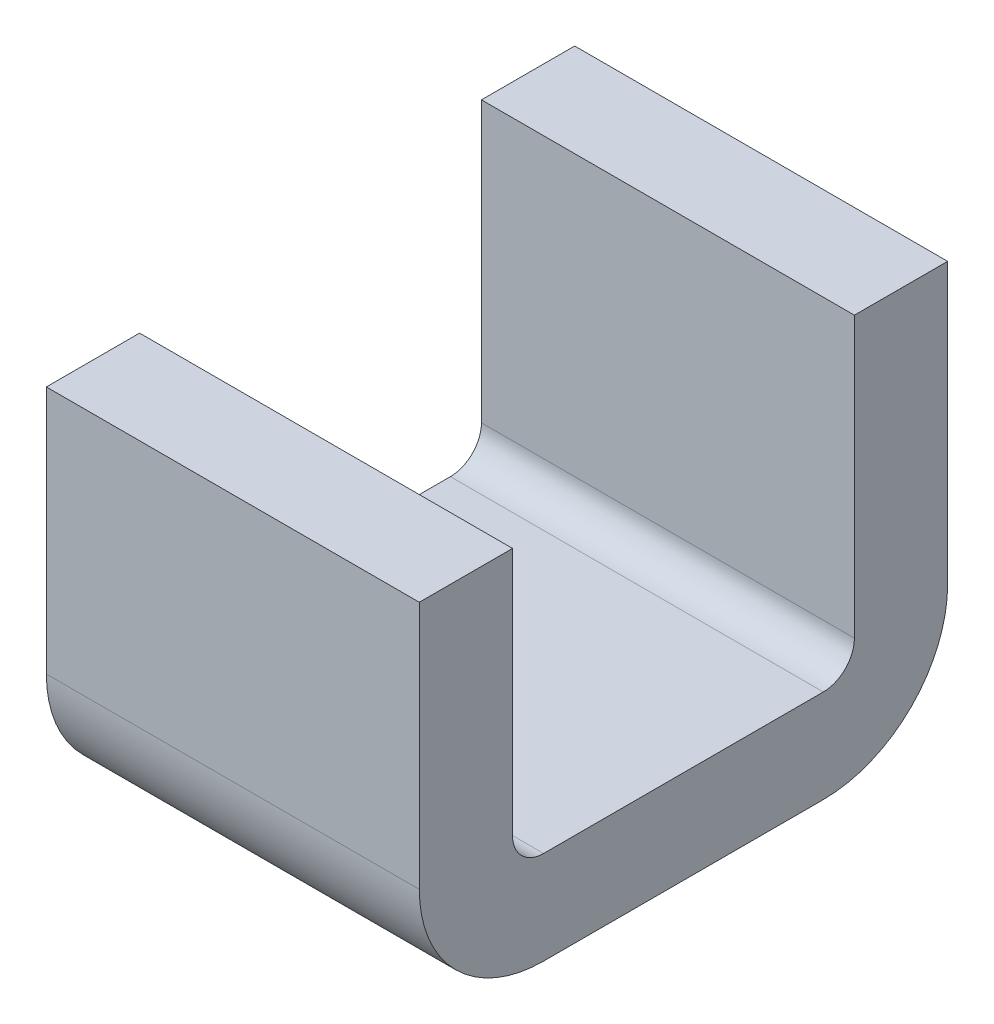
ISO-10303-21;
HEADER;
FILE_DESCRIPTION(('STEP AP214'),'2;1');
FILE_NAME('part.step','',(''),(''),'','','');
FILE_SCHEMA(('AUTOMOTIVE_DESIGN { 1 0 10303 214 1 1 1 1 }'));
ENDSEC;
DATA;
#1=APPLICATION_CONTEXT('core data for automotive mechanical design processes');
#2=APPLICATION_PROTOCOL_DEFINITION('international standard','automotive_design',2000,#1);
#3=PRODUCT_CONTEXT('',#1,'mechanical');
#4=PRODUCT('Part','Part','',(#3));
#5=PRODUCT_RELATED_PRODUCT_CATEGORY('part','',(#4));
#6=PRODUCT_DEFINITION_FORMATION('','',#4);
#7=PRODUCT_DEFINITION_CONTEXT('part definition',#1,'design');
#8=PRODUCT_DEFINITION('design','',#6,#7);
#9=PRODUCT_DEFINITION_SHAPE('','',#8);
#10=(LENGTH_UNIT() NAMED_UNIT(*) SI_UNIT(.MILLI.,.METRE.));
#11=(NAMED_UNIT(*) PLANE_ANGLE_UNIT() SI_UNIT($,.RADIAN.));
#12=(NAMED_UNIT(*) SI_UNIT($,.STERADIAN.) SOLID_ANGLE_UNIT());
#13=UNCERTAINTY_MEASURE_WITH_UNIT(LENGTH_MEASURE(1.E-05),#10,'distance_accuracy_value','');
#14=(GEOMETRIC_REPRESENTATION_CONTEXT(3) GLOBAL_UNCERTAINTY_ASSIGNED_CONTEXT((#13)) GLOBAL_UNIT_ASSIGNED_CONTEXT((#10,
#11,#12)) REPRESENTATION_CONTEXT('',''));
#15=CARTESIAN_POINT('',(0.,0.,0.));
#16=DIRECTION('',(0.,0.,1.));
#17=DIRECTION('',(1.,0.,0.));
#18=AXIS2_PLACEMENT_3D('',#15,#16,#17);
#19=CARTESIAN_POINT('',(0.699,-2.701,-7.7));
#20=DIRECTION('',(0.,0.,1.));
#21=DIRECTION('',(1.,0.,0.));
#22=AXIS2_PLACEMENT_3D('',#19,#20,#21);
#23=PLANE('',#22);
#24=DIRECTION('',(1.,0.,0.));
#25=VECTOR('',#24,1.);
#26=CARTESIAN_POINT('',(1.,-2.25,-7.7));
#27=LINE('',#26,#25);
#28=CARTESIAN_POINT('',(0.7,-2.25,-7.7));
#29=VERTEX_POINT('',#28);
#30=CARTESIAN_POINT('',(1.3,-2.25,-7.7));
#31=VERTEX_POINT('',#30);
#32=EDGE_CURVE('E162',#29,#31,#27,.T.);
#33=ORIENTED_EDGE('',*,*,#32,.F.);
#34=DIRECTION('',(0.,1.,0.));
#35=VECTOR('',#34,1.);
#36=CARTESIAN_POINT('',(0.7,-2.575,-7.7));
#37=LINE('',#36,#35);
#38=CARTESIAN_POINT('',(0.7,-2.7,-7.7));
#39=VERTEX_POINT('',#38);
#40=EDGE_CURVE('E169',#39,#29,#37,.T.);
#41=ORIENTED_EDGE('',*,*,#40,.F.);
#42=DIRECTION('',(-1.,0.,0.));
#43=VECTOR('',#42,1.);
#44=CARTESIAN_POINT('',(1.,-2.7,-7.7));
#45=LINE('',#44,#43);
#46=CARTESIAN_POINT('',(1.3,-2.7,-7.7));
#47=VERTEX_POINT('',#46);
#48=EDGE_CURVE('E131',#47,#39,#45,.T.);
#49=ORIENTED_EDGE('',*,*,#48,.F.);
#50=DIRECTION('',(0.,-1.,0.));
#51=VECTOR('',#50,1.);
#52=CARTESIAN_POINT('',(1.3,-2.575,-7.7));
#53=LINE('',#52,#51);
#54=EDGE_CURVE('E185',#31,#47,#53,.T.);
#55=ORIENTED_EDGE('',*,*,#54,.F.);
#56=EDGE_LOOP('',(#33,#41,#49,#55));
#57=FACE_BOUND('',#56,.T.);
#58=ADVANCED_FACE('F17',(#57),#23,.T.);
#59=CARTESIAN_POINT('',(1.301,-2.25,-7.851));
#60=DIRECTION('',(0.,1.,0.));
#61=DIRECTION('',(-1.,0.,0.));
#62=AXIS2_PLACEMENT_3D('',#59,#60,#61);
#63=PLANE('',#62);
#64=DIRECTION('',(1.,0.,0.));
#65=VECTOR('',#64,1.);
#66=CARTESIAN_POINT('',(1.,-2.25,-7.85));
#67=LINE('',#66,#65);
#68=CARTESIAN_POINT('',(0.7,-2.25,-7.85));
#69=VERTEX_POINT('',#68);
#70=CARTESIAN_POINT('',(1.3,-2.25,-7.85));
#71=VERTEX_POINT('',#70);
#72=EDGE_CURVE('E160',#69,#71,#67,.T.);
#73=ORIENTED_EDGE('',*,*,#72,.F.);
#74=DIRECTION('',(0.,0.,-1.));
#75=VECTOR('',#74,1.);
#76=CARTESIAN_POINT('',(0.7,-2.25,-7.425));
#77=LINE('',#76,#75);
#78=EDGE_CURVE('E165',#29,#69,#77,.T.);
#79=ORIENTED_EDGE('',*,*,#78,.F.);
#80=ORIENTED_EDGE('',*,*,#32,.T.);
#81=DIRECTION('',(0.,0.,1.));
#82=VECTOR('',#81,1.);
#83=CARTESIAN_POINT('',(1.3,-2.25,-7.425));
#84=LINE('',#83,#82);
#85=EDGE_CURVE('E182',#71,#31,#84,.T.);
#86=ORIENTED_EDGE('',*,*,#85,.F.);
#87=EDGE_LOOP('',(#73,#79,#80,#86));
#88=FACE_BOUND('',#87,.T.);
#89=ADVANCED_FACE('F263',(#88),#63,.T.);
#90=CARTESIAN_POINT('',(1.301,-2.701,-7.85));
#91=DIRECTION('',(0.,0.,-1.));
#92=DIRECTION('',(-1.,0.,0.));
#93=AXIS2_PLACEMENT_3D('',#90,#91,#92);
#94=PLANE('',#93);
#95=ORIENTED_EDGE('',*,*,#72,.T.);
#96=DIRECTION('',(0.,1.,0.));
#97=VECTOR('',#96,1.);
#98=CARTESIAN_POINT('',(1.3,-2.575,-7.85));
#99=LINE('',#98,#97);
#100=CARTESIAN_POINT('',(1.3,-2.7,-7.85));
#101=VERTEX_POINT('',#100);
#102=EDGE_CURVE('E186',#101,#71,#99,.T.);
#103=ORIENTED_EDGE('',*,*,#102,.F.);
#104=DIRECTION('',(1.,0.,0.));
#105=VECTOR('',#104,1.);
#106=CARTESIAN_POINT('',(1.,-2.7,-7.85));
#107=LINE('',#106,#105);
#108=CARTESIAN_POINT('',(0.7,-2.7,-7.85));
#109=VERTEX_POINT('',#108);
#110=EDGE_CURVE('E158',#109,#101,#107,.T.);
#111=ORIENTED_EDGE('',*,*,#110,.F.);
#112=DIRECTION('',(0.,-1.,0.));
#113=VECTOR('',#112,1.);
#114=CARTESIAN_POINT('',(0.7,-2.575,-7.85));
#115=LINE('',#114,#113);
#116=EDGE_CURVE('E168',#69,#109,#115,.T.);
#117=ORIENTED_EDGE('',*,*,#116,.F.);
#118=EDGE_LOOP('',(#95,#103,#111,#117));
#119=FACE_BOUND('',#118,.T.);
#120=ADVANCED_FACE('F259',(#119),#94,.T.);
#121=CARTESIAN_POINT('',(0.7,-2.7,-7.65));
#122=DIRECTION('',(1.,0.,0.));
#123=DIRECTION('',(0.,0.,-1.));
#124=AXIS2_PLACEMENT_3D('',#121,#122,#123);
#125=CYLINDRICAL_SURFACE('',#124,0.2);
#126=CARTESIAN_POINT('',(0.7,-2.7,-7.65));
#127=DIRECTION('',(1.,0.,0.));
#128=DIRECTION('',(0.,0.,-1.));
#129=AXIS2_PLACEMENT_3D('',#126,#127,#128);
#130=CIRCLE('',#129,0.2);
#131=CARTESIAN_POINT('',(0.7,-2.9,-7.65));
#132=VERTEX_POINT('',#131);
#133=EDGE_CURVE('E198',#109,#132,#130,.F.);
#134=ORIENTED_EDGE('',*,*,#133,.F.);
#135=ORIENTED_EDGE('',*,*,#110,.T.);
#136=CARTESIAN_POINT('',(1.3,-2.7,-7.65));
#137=DIRECTION('',(1.,0.,0.));
#138=DIRECTION('',(0.,0.,-1.));
#139=AXIS2_PLACEMENT_3D('',#136,#137,#138);
#140=CIRCLE('',#139,0.2);
#141=CARTESIAN_POINT('',(1.3,-2.9,-7.65));
#142=VERTEX_POINT('',#141);
#143=EDGE_CURVE('E202',#142,#101,#140,.T.);
#144=ORIENTED_EDGE('',*,*,#143,.F.);
#145=DIRECTION('',(1.,0.,0.));
#146=VECTOR('',#145,1.);
#147=CARTESIAN_POINT('',(1.,-2.9,-7.65));
#148=LINE('',#147,#146);
#149=EDGE_CURVE('E156',#132,#142,#148,.T.);
#150=ORIENTED_EDGE('',*,*,#149,.F.);
#151=EDGE_LOOP('',(#134,#135,#144,#150));
#152=FACE_BOUND('',#151,.T.);
#153=ADVANCED_FACE('F256',(#152),#125,.T.);
#154=CARTESIAN_POINT('',(0.699,-2.9,-7.651));
#155=DIRECTION('',(0.,-1.,0.));
#156=DIRECTION('',(1.,0.,0.));
#157=AXIS2_PLACEMENT_3D('',#154,#155,#156);
#158=PLANE('',#157);
#159=DIRECTION('',(1.,0.,0.));
#160=VECTOR('',#159,1.);
#161=CARTESIAN_POINT('',(1.,-2.9,-7.2));
#162=LINE('',#161,#160);
#163=CARTESIAN_POINT('',(0.7,-2.9,-7.2));
#164=VERTEX_POINT('',#163);
#165=CARTESIAN_POINT('',(1.3,-2.9,-7.2));
#166=VERTEX_POINT('',#165);
#167=EDGE_CURVE('E115',#164,#166,#162,.T.);
#168=ORIENTED_EDGE('',*,*,#167,.F.);
#169=DIRECTION('',(0.,0.,1.));
#170=VECTOR('',#169,1.);
#171=CARTESIAN_POINT('',(0.7,-2.9,-7.425));
#172=LINE('',#171,#170);
#173=EDGE_CURVE('E197',#132,#164,#172,.T.);
#174=ORIENTED_EDGE('',*,*,#173,.F.);
#175=ORIENTED_EDGE('',*,*,#149,.T.);
#176=DIRECTION('',(0.,0.,-1.));
#177=VECTOR('',#176,1.);
#178=CARTESIAN_POINT('',(1.3,-2.9,-7.425));
#179=LINE('',#178,#177);
#180=EDGE_CURVE('E204',#166,#142,#179,.T.);
#181=ORIENTED_EDGE('',*,*,#180,.F.);
#182=EDGE_LOOP('',(#168,#174,#175,#181));
#183=FACE_BOUND('',#182,.T.);
#184=ADVANCED_FACE('F251',(#183),#158,.T.);
#185=CARTESIAN_POINT('',(0.7,-2.7,-7.2));
#186=DIRECTION('',(1.,0.,0.));
#187=DIRECTION('',(0.,0.,-1.));
#188=AXIS2_PLACEMENT_3D('',#185,#186,#187);
#189=CYLINDRICAL_SURFACE('',#188,0.2);
#190=CARTESIAN_POINT('',(1.3,-2.7,-7.2));
#191=DIRECTION('',(1.,0.,0.));
#192=DIRECTION('',(0.,0.,-1.));
#193=AXIS2_PLACEMENT_3D('',#190,#191,#192);
#194=CIRCLE('',#193,0.2);
#195=CARTESIAN_POINT('',(1.3,-2.7,-7.));
#196=VERTEX_POINT('',#195);
#197=EDGE_CURVE('E205',#196,#166,#194,.T.);
#198=ORIENTED_EDGE('',*,*,#197,.F.);
#199=DIRECTION('',(1.,0.,0.));
#200=VECTOR('',#199,1.);
#201=CARTESIAN_POINT('',(1.,-2.7,-7.));
#202=LINE('',#201,#200);
#203=CARTESIAN_POINT('',(0.7,-2.7,-7.));
#204=VERTEX_POINT('',#203);
#205=EDGE_CURVE('E129',#204,#196,#202,.T.);
#206=ORIENTED_EDGE('',*,*,#205,.F.);
#207=CARTESIAN_POINT('',(0.7,-2.7,-7.2));
#208=DIRECTION('',(1.,0.,0.));
#209=DIRECTION('',(0.,0.,-1.));
#210=AXIS2_PLACEMENT_3D('',#207,#208,#209);
#211=CIRCLE('',#210,0.2);
#212=EDGE_CURVE('E193',#164,#204,#211,.F.);
#213=ORIENTED_EDGE('',*,*,#212,.F.);
#214=ORIENTED_EDGE('',*,*,#167,.T.);
#215=EDGE_LOOP('',(#198,#206,#213,#214));
#216=FACE_BOUND('',#215,.T.);
#217=ADVANCED_FACE('F247',(#216),#189,.T.);
#218=CARTESIAN_POINT('',(1.3,-2.7,-7.2));
#219=DIRECTION('',(-1.,0.,0.));
#220=DIRECTION('',(0.,0.,1.));
#221=AXIS2_PLACEMENT_3D('',#218,#219,#220);
#222=CYLINDRICAL_SURFACE('',#221,0.0500000000000005);
#223=DIRECTION('',(1.,0.,0.));
#224=VECTOR('',#223,1.);
#225=CARTESIAN_POINT('',(1.,-2.75,-7.2));
#226=LINE('',#225,#224);
#227=CARTESIAN_POINT('',(0.7,-2.75,-7.2));
#228=VERTEX_POINT('',#227);
#229=CARTESIAN_POINT('',(1.3,-2.75,-7.2));
#230=VERTEX_POINT('',#229);
#231=EDGE_CURVE('E103',#228,#230,#226,.T.);
#232=ORIENTED_EDGE('',*,*,#231,.F.);
#233=CARTESIAN_POINT('',(0.7,-2.7,-7.2));
#234=DIRECTION('',(-1.,0.,0.));
#235=DIRECTION('',(0.,0.,1.));
#236=AXIS2_PLACEMENT_3D('',#233,#234,#235);
#237=CIRCLE('',#236,0.0500000000000005);
#238=CARTESIAN_POINT('',(0.7,-2.7,-7.15));
#239=VERTEX_POINT('',#238);
#240=EDGE_CURVE('E191',#239,#228,#237,.F.);
#241=ORIENTED_EDGE('',*,*,#240,.F.);
#242=DIRECTION('',(-1.,0.,0.));
#243=VECTOR('',#242,1.);
#244=CARTESIAN_POINT('',(1.,-2.7,-7.15));
#245=LINE('',#244,#243);
#246=CARTESIAN_POINT('',(1.3,-2.7,-7.15));
#247=VERTEX_POINT('',#246);
#248=EDGE_CURVE('E120',#247,#239,#245,.T.);
#249=ORIENTED_EDGE('',*,*,#248,.F.);
#250=CARTESIAN_POINT('',(1.3,-2.7,-7.2));
#251=DIRECTION('',(-1.,0.,0.));
#252=DIRECTION('',(0.,0.,1.));
#253=AXIS2_PLACEMENT_3D('',#250,#251,#252);
#254=CIRCLE('',#253,0.0500000000000005);
#255=EDGE_CURVE('E21',#230,#247,#254,.T.);
#256=ORIENTED_EDGE('',*,*,#255,.F.);
#257=EDGE_LOOP('',(#232,#241,#249,#256));
#258=FACE_BOUND('',#257,.T.);
#259=ADVANCED_FACE('F119',(#258),#222,.F.);
#260=CARTESIAN_POINT('',(0.699,-2.75,-7.199));
#261=DIRECTION('',(0.,1.,0.));
#262=DIRECTION('',(1.,0.,0.));
#263=AXIS2_PLACEMENT_3D('',#260,#261,#262);
#264=PLANE('',#263);
#265=ORIENTED_EDGE('',*,*,#231,.T.);
#266=DIRECTION('',(0.,0.,1.));
#267=VECTOR('',#266,1.);
#268=CARTESIAN_POINT('',(1.3,-2.75,-7.425));
#269=LINE('',#268,#267);
#270=CARTESIAN_POINT('',(1.3,-2.75,-7.65));
#271=VERTEX_POINT('',#270);
#272=EDGE_CURVE('E107',#271,#230,#269,.T.);
#273=ORIENTED_EDGE('',*,*,#272,.F.);
#274=DIRECTION('',(1.,0.,0.));
#275=VECTOR('',#274,1.);
#276=CARTESIAN_POINT('',(1.,-2.75,-7.65));
#277=LINE('',#276,#275);
#278=CARTESIAN_POINT('',(0.7,-2.75,-7.65));
#279=VERTEX_POINT('',#278);
#280=EDGE_CURVE('E114',#279,#271,#277,.T.);
#281=ORIENTED_EDGE('',*,*,#280,.F.);
#282=DIRECTION('',(0.,0.,-1.));
#283=VECTOR('',#282,1.);
#284=CARTESIAN_POINT('',(0.7,-2.75,-7.425));
#285=LINE('',#284,#283);
#286=EDGE_CURVE('E110',#228,#279,#285,.T.);
#287=ORIENTED_EDGE('',*,*,#286,.F.);
#288=EDGE_LOOP('',(#265,#273,#281,#287));
#289=FACE_BOUND('',#288,.T.);
#290=ADVANCED_FACE('F105',(#289),#264,.T.);
#291=CARTESIAN_POINT('',(1.3,-2.7,-7.65));
#292=DIRECTION('',(-1.,0.,0.));
#293=DIRECTION('',(0.,0.,1.));
#294=AXIS2_PLACEMENT_3D('',#291,#292,#293);
#295=CYLINDRICAL_SURFACE('',#294,0.0500000000000002);
#296=ORIENTED_EDGE('',*,*,#48,.T.);
#297=CARTESIAN_POINT('',(0.7,-2.7,-7.65));
#298=DIRECTION('',(-1.,0.,0.));
#299=DIRECTION('',(0.,0.,1.));
#300=AXIS2_PLACEMENT_3D('',#297,#298,#299);
#301=CIRCLE('',#300,0.0500000000000002);
#302=EDGE_CURVE('E152',#279,#39,#301,.F.);
#303=ORIENTED_EDGE('',*,*,#302,.F.);
#304=ORIENTED_EDGE('',*,*,#280,.T.);
#305=CARTESIAN_POINT('',(1.3,-2.7,-7.65));
#306=DIRECTION('',(-1.,0.,0.));
#307=DIRECTION('',(0.,0.,1.));
#308=AXIS2_PLACEMENT_3D('',#305,#306,#307);
#309=CIRCLE('',#308,0.0500000000000002);
#310=EDGE_CURVE('E128',#47,#271,#309,.T.);
#311=ORIENTED_EDGE('',*,*,#310,.F.);
#312=EDGE_LOOP('',(#296,#303,#304,#311));
#313=FACE_BOUND('',#312,.T.);
#314=ADVANCED_FACE('F267',(#313),#295,.F.);
#315=CARTESIAN_POINT('',(0.699,-2.701,-7.));
#316=DIRECTION('',(0.,0.,1.));
#317=DIRECTION('',(1.,0.,0.));
#318=AXIS2_PLACEMENT_3D('',#315,#316,#317);
#319=PLANE('',#318);
#320=DIRECTION('',(0.,1.,0.));
#321=VECTOR('',#320,1.);
#322=CARTESIAN_POINT('',(0.7,-2.575,-7.));
#323=LINE('',#322,#321);
#324=CARTESIAN_POINT('',(0.7,-2.3,-7.));
#325=VERTEX_POINT('',#324);
#326=EDGE_CURVE('E196',#204,#325,#323,.T.);
#327=ORIENTED_EDGE('',*,*,#326,.F.);
#328=ORIENTED_EDGE('',*,*,#205,.T.);
#329=DIRECTION('',(0.,-1.,0.));
#330=VECTOR('',#329,1.);
#331=CARTESIAN_POINT('',(1.3,-2.575,-7.));
#332=LINE('',#331,#330);
#333=CARTESIAN_POINT('',(1.3,-2.3,-7.));
#334=VERTEX_POINT('',#333);
#335=EDGE_CURVE('E123',#334,#196,#332,.T.);
#336=ORIENTED_EDGE('',*,*,#335,.F.);
#337=DIRECTION('',(1.,0.,0.));
#338=VECTOR('',#337,1.);
#339=CARTESIAN_POINT('',(1.,-2.3,-7.));
#340=LINE('',#339,#338);
#341=EDGE_CURVE('E149',#325,#334,#340,.T.);
#342=ORIENTED_EDGE('',*,*,#341,.F.);
#343=EDGE_LOOP('',(#327,#328,#336,#342));
#344=FACE_BOUND('',#343,.T.);
#345=ADVANCED_FACE('F244',(#344),#319,.T.);
#346=CARTESIAN_POINT('',(1.3,-2.901,-7.851));
#347=DIRECTION('',(1.,0.,0.));
#348=DIRECTION('',(0.,1.,0.));
#349=AXIS2_PLACEMENT_3D('',#346,#347,#348);
#350=PLANE('',#349);
#351=ORIENTED_EDGE('',*,*,#54,.T.);
#352=ORIENTED_EDGE('',*,*,#310,.T.);
#353=ORIENTED_EDGE('',*,*,#272,.T.);
#354=ORIENTED_EDGE('',*,*,#255,.T.);
#355=DIRECTION('',(0.,-1.,0.));
#356=VECTOR('',#355,1.);
#357=CARTESIAN_POINT('',(1.3,-2.5,-7.15));
#358=LINE('',#357,#356);
#359=CARTESIAN_POINT('',(1.3,-2.3,-7.15));
#360=VERTEX_POINT('',#359);
#361=EDGE_CURVE('E140',#360,#247,#358,.T.);
#362=ORIENTED_EDGE('',*,*,#361,.F.);
#363=DIRECTION('',(0.,0.,-1.));
#364=VECTOR('',#363,1.);
#365=CARTESIAN_POINT('',(1.3,-2.3,-7.075));
#366=LINE('',#365,#364);
#367=EDGE_CURVE('E146',#334,#360,#366,.T.);
#368=ORIENTED_EDGE('',*,*,#367,.F.);
#369=ORIENTED_EDGE('',*,*,#335,.T.);
#370=ORIENTED_EDGE('',*,*,#197,.T.);
#371=ORIENTED_EDGE('',*,*,#180,.T.);
#372=ORIENTED_EDGE('',*,*,#143,.T.);
#373=ORIENTED_EDGE('',*,*,#102,.T.);
#374=ORIENTED_EDGE('',*,*,#85,.T.);
#375=EDGE_LOOP('',(#351,#352,#353,#354,#362,#368,#369,#370,#371,#372,#373,#374));
#376=FACE_BOUND('',#375,.T.);
#377=ADVANCED_FACE('F126',(#376),#350,.T.);
#378=CARTESIAN_POINT('',(1.301,-2.701,-7.15));
#379=DIRECTION('',(0.,0.,-1.));
#380=DIRECTION('',(-1.,0.,0.));
#381=AXIS2_PLACEMENT_3D('',#378,#379,#380);
#382=PLANE('',#381);
#383=DIRECTION('',(-1.,0.,0.));
#384=VECTOR('',#383,1.);
#385=CARTESIAN_POINT('',(1.,-2.3,-7.15));
#386=LINE('',#385,#384);
#387=CARTESIAN_POINT('',(0.7,-2.3,-7.15));
#388=VERTEX_POINT('',#387);
#389=EDGE_CURVE('E27',#360,#388,#386,.T.);
#390=ORIENTED_EDGE('',*,*,#389,.F.);
#391=ORIENTED_EDGE('',*,*,#361,.T.);
#392=ORIENTED_EDGE('',*,*,#248,.T.);
#393=DIRECTION('',(0.,-1.,0.));
#394=VECTOR('',#393,1.);
#395=CARTESIAN_POINT('',(0.7,-2.575,-7.15));
#396=LINE('',#395,#394);
#397=EDGE_CURVE('E36',#388,#239,#396,.T.);
#398=ORIENTED_EDGE('',*,*,#397,.F.);
#399=EDGE_LOOP('',(#390,#391,#392,#398));
#400=FACE_BOUND('',#399,.T.);
#401=ADVANCED_FACE('F242',(#400),#382,.T.);
#402=CARTESIAN_POINT('',(0.7,-2.249,-7.851));
#403=DIRECTION('',(-1.,0.,0.));
#404=DIRECTION('',(0.,-1.,0.));
#405=AXIS2_PLACEMENT_3D('',#402,#403,#404);
#406=PLANE('',#405);
#407=ORIENTED_EDGE('',*,*,#286,.T.);
#408=ORIENTED_EDGE('',*,*,#302,.T.);
#409=ORIENTED_EDGE('',*,*,#40,.T.);
#410=ORIENTED_EDGE('',*,*,#78,.T.);
#411=ORIENTED_EDGE('',*,*,#116,.T.);
#412=ORIENTED_EDGE('',*,*,#133,.T.);
#413=ORIENTED_EDGE('',*,*,#173,.T.);
#414=ORIENTED_EDGE('',*,*,#212,.T.);
#415=ORIENTED_EDGE('',*,*,#326,.T.);
#416=DIRECTION('',(0.,0.,1.));
#417=VECTOR('',#416,1.);
#418=CARTESIAN_POINT('',(0.7,-2.3,-7.075));
#419=LINE('',#418,#417);
#420=EDGE_CURVE('E11',#388,#325,#419,.T.);
#421=ORIENTED_EDGE('',*,*,#420,.F.);
#422=ORIENTED_EDGE('',*,*,#397,.T.);
#423=ORIENTED_EDGE('',*,*,#240,.T.);
#424=EDGE_LOOP('',(#407,#408,#409,#410,#411,#412,#413,#414,#415,#421,#422,#423));
#425=FACE_BOUND('',#424,.T.);
#426=ADVANCED_FACE('F238',(#425),#406,.T.);
#427=CARTESIAN_POINT('',(1.301,-2.3,-7.151));
#428=DIRECTION('',(0.,1.,0.));
#429=DIRECTION('',(-1.,0.,0.));
#430=AXIS2_PLACEMENT_3D('',#427,#428,#429);
#431=PLANE('',#430);
#432=ORIENTED_EDGE('',*,*,#389,.T.);
#433=ORIENTED_EDGE('',*,*,#420,.T.);
#434=ORIENTED_EDGE('',*,*,#341,.T.);
#435=ORIENTED_EDGE('',*,*,#367,.T.);
#436=EDGE_LOOP('',(#432,#433,#434,#435));
#437=FACE_BOUND('',#436,.T.);
#438=ADVANCED_FACE('F19',(#437),#431,.T.);
#439=CLOSED_SHELL('',(#58,#89,#120,#153,#184,#217,#259,#290,#314,#345,#377,#401,#426,#438));
#440=MANIFOLD_SOLID_BREP('B1',#439);
#441=ADVANCED_BREP_SHAPE_REPRESENTATION('',(#18,#440),#14);
#442=SHAPE_DEFINITION_REPRESENTATION(#9,#441);
ENDSEC;
END-ISO-10303-21;
